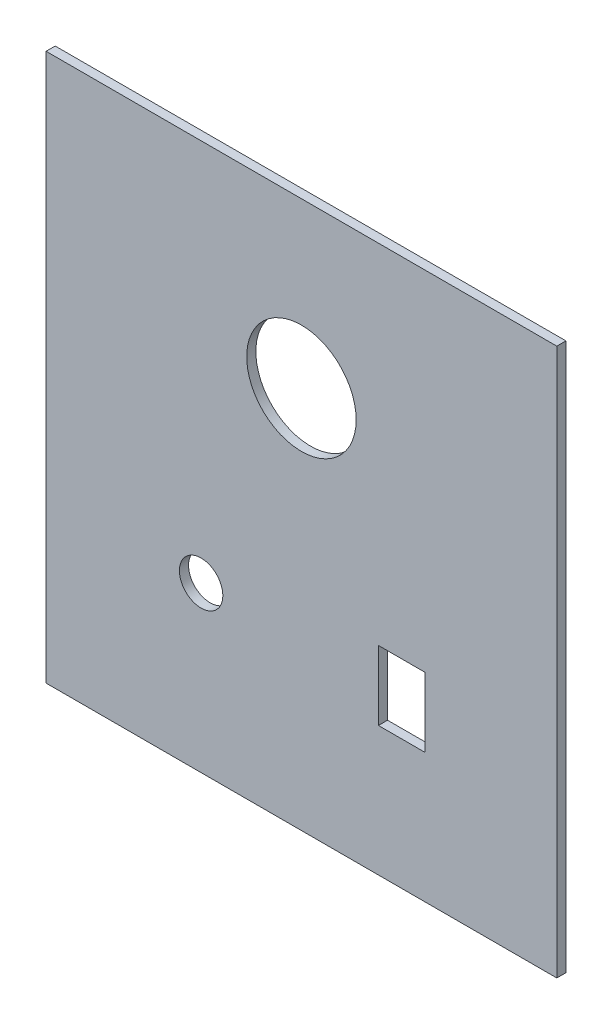
ISO-10303-21;
HEADER;
FILE_DESCRIPTION(('STEP AP214'),'2;1');
FILE_NAME('part.step','',(''),(''),'','','');
FILE_SCHEMA(('AUTOMOTIVE_DESIGN { 1 0 10303 214 1 1 1 1 }'));
ENDSEC;
DATA;
#1=APPLICATION_CONTEXT('core data for automotive mechanical design processes');
#2=APPLICATION_PROTOCOL_DEFINITION('international standard','automotive_design',2000,#1);
#3=PRODUCT_CONTEXT('',#1,'mechanical');
#4=PRODUCT('Part','Part','',(#3));
#5=PRODUCT_RELATED_PRODUCT_CATEGORY('part','',(#4));
#6=PRODUCT_DEFINITION_FORMATION('','',#4);
#7=PRODUCT_DEFINITION_CONTEXT('part definition',#1,'design');
#8=PRODUCT_DEFINITION('design','',#6,#7);
#9=PRODUCT_DEFINITION_SHAPE('','',#8);
#10=(LENGTH_UNIT() NAMED_UNIT(*) SI_UNIT(.MILLI.,.METRE.));
#11=(NAMED_UNIT(*) PLANE_ANGLE_UNIT() SI_UNIT($,.RADIAN.));
#12=(NAMED_UNIT(*) SI_UNIT($,.STERADIAN.) SOLID_ANGLE_UNIT());
#13=UNCERTAINTY_MEASURE_WITH_UNIT(LENGTH_MEASURE(1.E-05),#10,'distance_accuracy_value','');
#14=(GEOMETRIC_REPRESENTATION_CONTEXT(3) GLOBAL_UNCERTAINTY_ASSIGNED_CONTEXT((#13)) GLOBAL_UNIT_ASSIGNED_CONTEXT((#10,
#11,#12)) REPRESENTATION_CONTEXT('',''));
#15=CARTESIAN_POINT('',(0.,0.,0.));
#16=DIRECTION('',(0.,0.,1.));
#17=DIRECTION('',(1.,0.,0.));
#18=AXIS2_PLACEMENT_3D('',#15,#16,#17);
#19=CARTESIAN_POINT('',(0.,-20.5,2.5));
#20=DIRECTION('',(0.,1.,0.));
#21=DIRECTION('',(0.,0.,1.));
#22=AXIS2_PLACEMENT_3D('',#19,#20,#21);
#23=PLANE('',#22);
#24=DIRECTION('',(1.,0.,0.));
#25=VECTOR('',#24,1.);
#26=CARTESIAN_POINT('',(0.,-20.5,0.));
#27=LINE('',#26,#25);
#28=CARTESIAN_POINT('',(21.1,-20.5,0.));
#29=VERTEX_POINT('',#28);
#30=CARTESIAN_POINT('',(33.9,-20.5,0.));
#31=VERTEX_POINT('',#30);
#32=EDGE_CURVE('E148',#29,#31,#27,.T.);
#33=ORIENTED_EDGE('',*,*,#32,.T.);
#34=DIRECTION('',(0.,0.,-1.));
#35=VECTOR('',#34,1.);
#36=CARTESIAN_POINT('',(33.9,-20.5,2.5));
#37=LINE('',#36,#35);
#38=CARTESIAN_POINT('',(33.9,-20.5,2.5));
#39=VERTEX_POINT('',#38);
#40=EDGE_CURVE('E11',#39,#31,#37,.T.);
#41=ORIENTED_EDGE('',*,*,#40,.F.);
#42=DIRECTION('',(1.,0.,0.));
#43=VECTOR('',#42,1.);
#44=CARTESIAN_POINT('',(0.,-20.5,2.5));
#45=LINE('',#44,#43);
#46=CARTESIAN_POINT('',(21.1,-20.5,2.5));
#47=VERTEX_POINT('',#46);
#48=EDGE_CURVE('E113',#47,#39,#45,.T.);
#49=ORIENTED_EDGE('',*,*,#48,.F.);
#50=DIRECTION('',(0.,0.,-1.));
#51=VECTOR('',#50,1.);
#52=CARTESIAN_POINT('',(21.1,-20.5,2.5));
#53=LINE('',#52,#51);
#54=EDGE_CURVE('E52',#47,#29,#53,.T.);
#55=ORIENTED_EDGE('',*,*,#54,.T.);
#56=EDGE_LOOP('',(#33,#41,#49,#55));
#57=FACE_BOUND('',#56,.T.);
#58=ADVANCED_FACE('F33',(#57),#23,.F.);
#59=CARTESIAN_POINT('',(33.9,0.,2.5));
#60=DIRECTION('',(1.,0.,0.));
#61=DIRECTION('',(0.,0.,-1.));
#62=AXIS2_PLACEMENT_3D('',#59,#60,#61);
#63=PLANE('',#62);
#64=DIRECTION('',(0.,-1.,0.));
#65=VECTOR('',#64,1.);
#66=CARTESIAN_POINT('',(33.9,0.,0.));
#67=LINE('',#66,#65);
#68=CARTESIAN_POINT('',(33.9,-39.5,0.));
#69=VERTEX_POINT('',#68);
#70=EDGE_CURVE('E119',#31,#69,#67,.T.);
#71=ORIENTED_EDGE('',*,*,#70,.T.);
#72=DIRECTION('',(0.,0.,-1.));
#73=VECTOR('',#72,1.);
#74=CARTESIAN_POINT('',(33.9,-39.5,2.5));
#75=LINE('',#74,#73);
#76=CARTESIAN_POINT('',(33.9,-39.5,2.5));
#77=VERTEX_POINT('',#76);
#78=EDGE_CURVE('E43',#77,#69,#75,.T.);
#79=ORIENTED_EDGE('',*,*,#78,.F.);
#80=DIRECTION('',(0.,-1.,0.));
#81=VECTOR('',#80,1.);
#82=CARTESIAN_POINT('',(33.9,0.,2.5));
#83=LINE('',#82,#81);
#84=EDGE_CURVE('E107',#39,#77,#83,.T.);
#85=ORIENTED_EDGE('',*,*,#84,.F.);
#86=ORIENTED_EDGE('',*,*,#40,.T.);
#87=EDGE_LOOP('',(#71,#79,#85,#86));
#88=FACE_BOUND('',#87,.T.);
#89=ADVANCED_FACE('F118',(#88),#63,.F.);
#90=CARTESIAN_POINT('',(0.,-39.5,2.5));
#91=DIRECTION('',(0.,1.,0.));
#92=DIRECTION('',(0.,0.,1.));
#93=AXIS2_PLACEMENT_3D('',#90,#91,#92);
#94=PLANE('',#93);
#95=DIRECTION('',(1.,0.,0.));
#96=VECTOR('',#95,1.);
#97=CARTESIAN_POINT('',(0.,-39.5,0.));
#98=LINE('',#97,#96);
#99=CARTESIAN_POINT('',(21.1,-39.5,0.));
#100=VERTEX_POINT('',#99);
#101=EDGE_CURVE('E151',#100,#69,#98,.T.);
#102=ORIENTED_EDGE('',*,*,#101,.F.);
#103=DIRECTION('',(0.,0.,-1.));
#104=VECTOR('',#103,1.);
#105=CARTESIAN_POINT('',(21.1,-39.5,2.5));
#106=LINE('',#105,#104);
#107=CARTESIAN_POINT('',(21.1,-39.5,2.5));
#108=VERTEX_POINT('',#107);
#109=EDGE_CURVE('E78',#108,#100,#106,.T.);
#110=ORIENTED_EDGE('',*,*,#109,.F.);
#111=DIRECTION('',(1.,0.,0.));
#112=VECTOR('',#111,1.);
#113=CARTESIAN_POINT('',(0.,-39.5,2.5));
#114=LINE('',#113,#112);
#115=EDGE_CURVE('E112',#108,#77,#114,.T.);
#116=ORIENTED_EDGE('',*,*,#115,.T.);
#117=ORIENTED_EDGE('',*,*,#78,.T.);
#118=EDGE_LOOP('',(#102,#110,#116,#117));
#119=FACE_BOUND('',#118,.T.);
#120=ADVANCED_FACE('F123',(#119),#94,.T.);
#121=CARTESIAN_POINT('',(0.,-75.,2.5));
#122=DIRECTION('',(0.,1.,0.));
#123=DIRECTION('',(0.,0.,1.));
#124=AXIS2_PLACEMENT_3D('',#121,#122,#123);
#125=PLANE('',#124);
#126=DIRECTION('',(1.,0.,0.));
#127=VECTOR('',#126,1.);
#128=CARTESIAN_POINT('',(0.,-75.,0.));
#129=LINE('',#128,#127);
#130=CARTESIAN_POINT('',(-70.,-75.,0.));
#131=VERTEX_POINT('',#130);
#132=CARTESIAN_POINT('',(70.0000000000001,-75.,0.));
#133=VERTEX_POINT('',#132);
#134=EDGE_CURVE('E136',#131,#133,#129,.T.);
#135=ORIENTED_EDGE('',*,*,#134,.T.);
#136=DIRECTION('',(0.,0.,-1.));
#137=VECTOR('',#136,1.);
#138=CARTESIAN_POINT('',(70.0000000000001,-75.,2.5));
#139=LINE('',#138,#137);
#140=CARTESIAN_POINT('',(70.0000000000001,-75.,2.5));
#141=VERTEX_POINT('',#140);
#142=EDGE_CURVE('E37',#141,#133,#139,.T.);
#143=ORIENTED_EDGE('',*,*,#142,.F.);
#144=DIRECTION('',(1.,0.,0.));
#145=VECTOR('',#144,1.);
#146=CARTESIAN_POINT('',(0.,-75.,2.5));
#147=LINE('',#146,#145);
#148=CARTESIAN_POINT('',(-70.,-75.,2.5));
#149=VERTEX_POINT('',#148);
#150=EDGE_CURVE('E217',#149,#141,#147,.T.);
#151=ORIENTED_EDGE('',*,*,#150,.F.);
#152=DIRECTION('',(0.,0.,-1.));
#153=VECTOR('',#152,1.);
#154=CARTESIAN_POINT('',(-70.,-75.,2.5));
#155=LINE('',#154,#153);
#156=EDGE_CURVE('E126',#149,#131,#155,.T.);
#157=ORIENTED_EDGE('',*,*,#156,.T.);
#158=EDGE_LOOP('',(#135,#143,#151,#157));
#159=FACE_BOUND('',#158,.T.);
#160=ADVANCED_FACE('F170',(#159),#125,.F.);
#161=CARTESIAN_POINT('',(70.0000000000001,0.,2.5));
#162=DIRECTION('',(-1.,0.,0.));
#163=DIRECTION('',(0.,0.,1.));
#164=AXIS2_PLACEMENT_3D('',#161,#162,#163);
#165=PLANE('',#164);
#166=DIRECTION('',(0.,1.,0.));
#167=VECTOR('',#166,1.);
#168=CARTESIAN_POINT('',(70.0000000000001,0.,0.));
#169=LINE('',#168,#167);
#170=CARTESIAN_POINT('',(70.0000000000001,75.,0.));
#171=VERTEX_POINT('',#170);
#172=EDGE_CURVE('E139',#133,#171,#169,.T.);
#173=ORIENTED_EDGE('',*,*,#172,.T.);
#174=DIRECTION('',(0.,0.,-1.));
#175=VECTOR('',#174,1.);
#176=CARTESIAN_POINT('',(70.0000000000001,75.,2.5));
#177=LINE('',#176,#175);
#178=CARTESIAN_POINT('',(70.0000000000001,75.,2.5));
#179=VERTEX_POINT('',#178);
#180=EDGE_CURVE('E161',#179,#171,#177,.T.);
#181=ORIENTED_EDGE('',*,*,#180,.F.);
#182=DIRECTION('',(0.,1.,0.));
#183=VECTOR('',#182,1.);
#184=CARTESIAN_POINT('',(70.0000000000001,0.,2.5));
#185=LINE('',#184,#183);
#186=EDGE_CURVE('E91',#141,#179,#185,.T.);
#187=ORIENTED_EDGE('',*,*,#186,.F.);
#188=ORIENTED_EDGE('',*,*,#142,.T.);
#189=EDGE_LOOP('',(#173,#181,#187,#188));
#190=FACE_BOUND('',#189,.T.);
#191=ADVANCED_FACE('F166',(#190),#165,.F.);
#192=CARTESIAN_POINT('',(0.,75.,2.5));
#193=DIRECTION('',(0.,1.,0.));
#194=DIRECTION('',(0.,0.,1.));
#195=AXIS2_PLACEMENT_3D('',#192,#193,#194);
#196=PLANE('',#195);
#197=DIRECTION('',(1.,0.,0.));
#198=VECTOR('',#197,1.);
#199=CARTESIAN_POINT('',(0.,75.,0.));
#200=LINE('',#199,#198);
#201=CARTESIAN_POINT('',(-70.,75.,0.));
#202=VERTEX_POINT('',#201);
#203=EDGE_CURVE('E142',#202,#171,#200,.T.);
#204=ORIENTED_EDGE('',*,*,#203,.F.);
#205=DIRECTION('',(0.,0.,-1.));
#206=VECTOR('',#205,1.);
#207=CARTESIAN_POINT('',(-70.,75.,2.5));
#208=LINE('',#207,#206);
#209=CARTESIAN_POINT('',(-70.,75.,2.5));
#210=VERTEX_POINT('',#209);
#211=EDGE_CURVE('E160',#210,#202,#208,.T.);
#212=ORIENTED_EDGE('',*,*,#211,.F.);
#213=DIRECTION('',(1.,0.,0.));
#214=VECTOR('',#213,1.);
#215=CARTESIAN_POINT('',(0.,75.,2.5));
#216=LINE('',#215,#214);
#217=EDGE_CURVE('E219',#210,#179,#216,.T.);
#218=ORIENTED_EDGE('',*,*,#217,.T.);
#219=ORIENTED_EDGE('',*,*,#180,.T.);
#220=EDGE_LOOP('',(#204,#212,#218,#219));
#221=FACE_BOUND('',#220,.T.);
#222=ADVANCED_FACE('F181',(#221),#196,.T.);
#223=CARTESIAN_POINT('',(-70.,0.,2.5));
#224=DIRECTION('',(-1.,0.,0.));
#225=DIRECTION('',(0.,0.,1.));
#226=AXIS2_PLACEMENT_3D('',#223,#224,#225);
#227=PLANE('',#226);
#228=DIRECTION('',(0.,1.,0.));
#229=VECTOR('',#228,1.);
#230=CARTESIAN_POINT('',(-70.,0.,0.));
#231=LINE('',#230,#229);
#232=EDGE_CURVE('E145',#131,#202,#231,.T.);
#233=ORIENTED_EDGE('',*,*,#232,.F.);
#234=ORIENTED_EDGE('',*,*,#156,.F.);
#235=DIRECTION('',(0.,1.,0.));
#236=VECTOR('',#235,1.);
#237=CARTESIAN_POINT('',(-70.,0.,2.5));
#238=LINE('',#237,#236);
#239=EDGE_CURVE('E179',#149,#210,#238,.T.);
#240=ORIENTED_EDGE('',*,*,#239,.T.);
#241=ORIENTED_EDGE('',*,*,#211,.T.);
#242=EDGE_LOOP('',(#233,#234,#240,#241));
#243=FACE_BOUND('',#242,.T.);
#244=ADVANCED_FACE('F176',(#243),#227,.T.);
#245=CARTESIAN_POINT('',(0.,30.,2.5));
#246=DIRECTION('',(0.,0.,-1.));
#247=DIRECTION('',(-1.,0.,0.));
#248=AXIS2_PLACEMENT_3D('',#245,#246,#247);
#249=CYLINDRICAL_SURFACE('',#248,15.);
#250=CARTESIAN_POINT('',(0.,30.,2.5));
#251=DIRECTION('',(0.,0.,1.));
#252=DIRECTION('',(1.,0.,0.));
#253=AXIS2_PLACEMENT_3D('',#250,#251,#252);
#254=CIRCLE('',#253,15.);
#255=CARTESIAN_POINT('',(15.,30.,2.5));
#256=VERTEX_POINT('',#255);
#257=EDGE_CURVE('E216',#256,#256,#254,.T.);
#258=ORIENTED_EDGE('',*,*,#257,.T.);
#259=EDGE_LOOP('',(#258));
#260=FACE_BOUND('',#259,.T.);
#261=CARTESIAN_POINT('',(0.,30.,0.));
#262=DIRECTION('',(0.,0.,1.));
#263=DIRECTION('',(1.,0.,0.));
#264=AXIS2_PLACEMENT_3D('',#261,#262,#263);
#265=CIRCLE('',#264,15.);
#266=CARTESIAN_POINT('',(15.,30.,0.));
#267=VERTEX_POINT('',#266);
#268=EDGE_CURVE('E133',#267,#267,#265,.T.);
#269=ORIENTED_EDGE('',*,*,#268,.F.);
#270=EDGE_LOOP('',(#269));
#271=FACE_BOUND('',#270,.T.);
#272=ADVANCED_FACE('F188',(#260,#271),#249,.F.);
#273=CARTESIAN_POINT('',(-27.5,-30.,2.5));
#274=DIRECTION('',(0.,0.,-1.));
#275=DIRECTION('',(-1.,0.,0.));
#276=AXIS2_PLACEMENT_3D('',#273,#274,#275);
#277=CYLINDRICAL_SURFACE('',#276,5.95);
#278=CARTESIAN_POINT('',(-27.5,-30.,2.5));
#279=DIRECTION('',(0.,0.,1.));
#280=DIRECTION('',(1.,0.,0.));
#281=AXIS2_PLACEMENT_3D('',#278,#279,#280);
#282=CIRCLE('',#281,5.95);
#283=CARTESIAN_POINT('',(-21.55,-30.,2.5));
#284=VERTEX_POINT('',#283);
#285=EDGE_CURVE('E156',#284,#284,#282,.T.);
#286=ORIENTED_EDGE('',*,*,#285,.T.);
#287=EDGE_LOOP('',(#286));
#288=FACE_BOUND('',#287,.T.);
#289=CARTESIAN_POINT('',(-27.5,-30.,0.));
#290=DIRECTION('',(0.,0.,1.));
#291=DIRECTION('',(1.,0.,0.));
#292=AXIS2_PLACEMENT_3D('',#289,#290,#291);
#293=CIRCLE('',#292,5.95);
#294=CARTESIAN_POINT('',(-21.55,-30.,0.));
#295=VERTEX_POINT('',#294);
#296=EDGE_CURVE('E130',#295,#295,#293,.T.);
#297=ORIENTED_EDGE('',*,*,#296,.F.);
#298=EDGE_LOOP('',(#297));
#299=FACE_BOUND('',#298,.T.);
#300=ADVANCED_FACE('F35',(#288,#299),#277,.F.);
#301=CARTESIAN_POINT('',(21.1,0.,2.5));
#302=DIRECTION('',(1.,0.,0.));
#303=DIRECTION('',(0.,1.,0.));
#304=AXIS2_PLACEMENT_3D('',#301,#302,#303);
#305=PLANE('',#304);
#306=DIRECTION('',(0.,-1.,0.));
#307=VECTOR('',#306,1.);
#308=CARTESIAN_POINT('',(21.1,0.,0.));
#309=LINE('',#308,#307);
#310=EDGE_CURVE('E153',#29,#100,#309,.T.);
#311=ORIENTED_EDGE('',*,*,#310,.F.);
#312=ORIENTED_EDGE('',*,*,#54,.F.);
#313=DIRECTION('',(0.,-1.,0.));
#314=VECTOR('',#313,1.);
#315=CARTESIAN_POINT('',(21.1,0.,2.5));
#316=LINE('',#315,#314);
#317=EDGE_CURVE('E124',#47,#108,#316,.T.);
#318=ORIENTED_EDGE('',*,*,#317,.T.);
#319=ORIENTED_EDGE('',*,*,#109,.T.);
#320=EDGE_LOOP('',(#311,#312,#318,#319));
#321=FACE_BOUND('',#320,.T.);
#322=ADVANCED_FACE('F200',(#321),#305,.T.);
#323=CARTESIAN_POINT('',(0.,0.,2.5));
#324=DIRECTION('',(0.,0.,1.));
#325=DIRECTION('',(1.,0.,0.));
#326=AXIS2_PLACEMENT_3D('',#323,#324,#325);
#327=PLANE('',#326);
#328=ORIENTED_EDGE('',*,*,#285,.F.);
#329=EDGE_LOOP('',(#328));
#330=FACE_BOUND('',#329,.T.);
#331=ORIENTED_EDGE('',*,*,#257,.F.);
#332=EDGE_LOOP('',(#331));
#333=FACE_BOUND('',#332,.T.);
#334=ORIENTED_EDGE('',*,*,#150,.T.);
#335=ORIENTED_EDGE('',*,*,#186,.T.);
#336=ORIENTED_EDGE('',*,*,#217,.F.);
#337=ORIENTED_EDGE('',*,*,#239,.F.);
#338=EDGE_LOOP('',(#334,#335,#336,#337));
#339=FACE_BOUND('',#338,.T.);
#340=ORIENTED_EDGE('',*,*,#48,.T.);
#341=ORIENTED_EDGE('',*,*,#84,.T.);
#342=ORIENTED_EDGE('',*,*,#115,.F.);
#343=ORIENTED_EDGE('',*,*,#317,.F.);
#344=EDGE_LOOP('',(#340,#341,#342,#343));
#345=FACE_BOUND('',#344,.T.);
#346=ADVANCED_FACE('F109',(#330,#333,#339,#345),#327,.T.);
#347=CARTESIAN_POINT('',(0.,0.,0.));
#348=DIRECTION('',(0.,0.,1.));
#349=DIRECTION('',(1.,0.,0.));
#350=AXIS2_PLACEMENT_3D('',#347,#348,#349);
#351=PLANE('',#350);
#352=ORIENTED_EDGE('',*,*,#296,.T.);
#353=EDGE_LOOP('',(#352));
#354=FACE_BOUND('',#353,.T.);
#355=ORIENTED_EDGE('',*,*,#268,.T.);
#356=EDGE_LOOP('',(#355));
#357=FACE_BOUND('',#356,.T.);
#358=ORIENTED_EDGE('',*,*,#134,.F.);
#359=ORIENTED_EDGE('',*,*,#232,.T.);
#360=ORIENTED_EDGE('',*,*,#203,.T.);
#361=ORIENTED_EDGE('',*,*,#172,.F.);
#362=EDGE_LOOP('',(#358,#359,#360,#361));
#363=FACE_BOUND('',#362,.T.);
#364=ORIENTED_EDGE('',*,*,#32,.F.);
#365=ORIENTED_EDGE('',*,*,#310,.T.);
#366=ORIENTED_EDGE('',*,*,#101,.T.);
#367=ORIENTED_EDGE('',*,*,#70,.F.);
#368=EDGE_LOOP('',(#364,#365,#366,#367));
#369=FACE_BOUND('',#368,.T.);
#370=ADVANCED_FACE('F173',(#354,#357,#363,#369),#351,.F.);
#371=CLOSED_SHELL('',(#58,#89,#120,#160,#191,#222,#244,#272,#300,#322,#346,#370));
#372=MANIFOLD_SOLID_BREP('B2',#371);
#373=ADVANCED_BREP_SHAPE_REPRESENTATION('',(#18,#372),#14);
#374=SHAPE_DEFINITION_REPRESENTATION(#9,#373);
ENDSEC;
END-ISO-10303-21;
